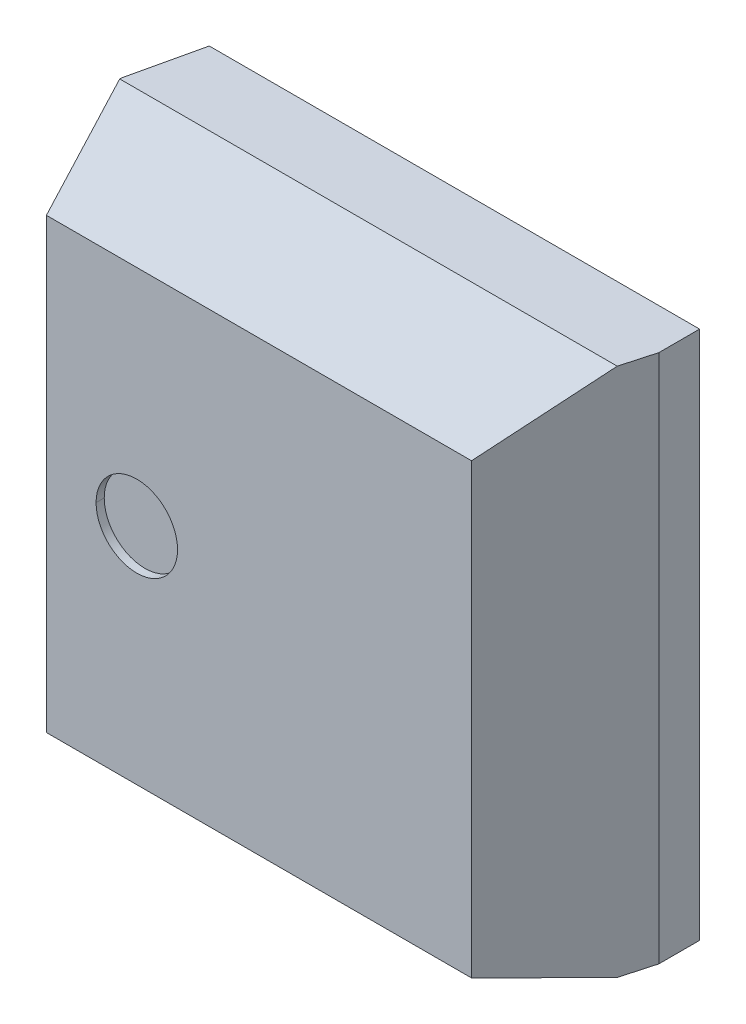
ISO-10303-21;
HEADER;
FILE_DESCRIPTION(('STEP AP214'),'2;1');
FILE_NAME('part.step','',(''),(''),'','','');
FILE_SCHEMA(('AUTOMOTIVE_DESIGN { 1 0 10303 214 1 1 1 1 }'));
ENDSEC;
DATA;
#1=APPLICATION_CONTEXT('core data for automotive mechanical design processes');
#2=APPLICATION_PROTOCOL_DEFINITION('international standard','automotive_design',2000,#1);
#3=PRODUCT_CONTEXT('',#1,'mechanical');
#4=PRODUCT('Part','Part','',(#3));
#5=PRODUCT_RELATED_PRODUCT_CATEGORY('part','',(#4));
#6=PRODUCT_DEFINITION_FORMATION('','',#4);
#7=PRODUCT_DEFINITION_CONTEXT('part definition',#1,'design');
#8=PRODUCT_DEFINITION('design','',#6,#7);
#9=PRODUCT_DEFINITION_SHAPE('','',#8);
#10=(LENGTH_UNIT() NAMED_UNIT(*) SI_UNIT(.MILLI.,.METRE.));
#11=(NAMED_UNIT(*) PLANE_ANGLE_UNIT() SI_UNIT($,.RADIAN.));
#12=(NAMED_UNIT(*) SI_UNIT($,.STERADIAN.) SOLID_ANGLE_UNIT());
#13=UNCERTAINTY_MEASURE_WITH_UNIT(LENGTH_MEASURE(1.E-05),#10,'distance_accuracy_value','');
#14=(GEOMETRIC_REPRESENTATION_CONTEXT(3) GLOBAL_UNCERTAINTY_ASSIGNED_CONTEXT((#13)) GLOBAL_UNIT_ASSIGNED_CONTEXT((#10,
#11,#12)) REPRESENTATION_CONTEXT('',''));
#15=CARTESIAN_POINT('',(0.,0.,0.));
#16=DIRECTION('',(0.,0.,1.));
#17=DIRECTION('',(1.,0.,0.));
#18=AXIS2_PLACEMENT_3D('',#15,#16,#17);
#19=CARTESIAN_POINT('',(197.946744279938,101.53204329235,114.531582908599));
#20=DIRECTION('',(0.,0.,-1.));
#21=DIRECTION('',(-1.,0.,0.));
#22=AXIS2_PLACEMENT_3D('',#19,#20,#21);
#23=CYLINDRICAL_SURFACE('',#22,0.5);
#24=CARTESIAN_POINT('',(197.946744279938,101.53204329235,114.531582908599));
#25=DIRECTION('',(0.,0.,-1.));
#26=DIRECTION('',(-1.,0.,0.));
#27=AXIS2_PLACEMENT_3D('',#24,#25,#26);
#28=CIRCLE('',#27,0.5);
#29=CARTESIAN_POINT('',(198.446744279938,101.53204329235,114.531582908599));
#30=VERTEX_POINT('',#29);
#31=CARTESIAN_POINT('',(197.446744279938,101.53204329235,114.531582908599));
#32=VERTEX_POINT('',#31);
#33=EDGE_CURVE('E67',#30,#32,#28,.T.);
#34=ORIENTED_EDGE('',*,*,#33,.F.);
#35=DIRECTION('',(0.,0.,-1.));
#36=VECTOR('',#35,1.);
#37=CARTESIAN_POINT('',(198.446744279938,101.53204329235,114.531582908599));
#38=LINE('',#37,#36);
#39=CARTESIAN_POINT('',(198.446744279938,101.53204329235,114.431582908599));
#40=VERTEX_POINT('',#39);
#41=EDGE_CURVE('E11',#30,#40,#38,.T.);
#42=ORIENTED_EDGE('',*,*,#41,.T.);
#43=CARTESIAN_POINT('',(197.946744279938,101.53204329235,114.431582908599));
#44=DIRECTION('',(0.,0.,-1.));
#45=DIRECTION('',(-1.,0.,0.));
#46=AXIS2_PLACEMENT_3D('',#43,#44,#45);
#47=CIRCLE('',#46,0.5);
#48=CARTESIAN_POINT('',(197.446744279938,101.53204329235,114.431582908599));
#49=VERTEX_POINT('',#48);
#50=EDGE_CURVE('E55',#40,#49,#47,.T.);
#51=ORIENTED_EDGE('',*,*,#50,.T.);
#52=DIRECTION('',(0.,0.,-1.));
#53=VECTOR('',#52,1.);
#54=CARTESIAN_POINT('',(197.446744279938,101.53204329235,114.531582908599));
#55=LINE('',#54,#53);
#56=EDGE_CURVE('E48',#32,#49,#55,.T.);
#57=ORIENTED_EDGE('',*,*,#56,.F.);
#58=EDGE_LOOP('',(#34,#42,#51,#57));
#59=FACE_BOUND('',#58,.T.);
#60=ADVANCED_FACE('F44',(#59),#23,.F.);
#61=CARTESIAN_POINT('',(197.946744279938,101.53204329235,114.431582908599));
#62=DIRECTION('',(0.,0.,-1.));
#63=DIRECTION('',(-1.,0.,0.));
#64=AXIS2_PLACEMENT_3D('',#61,#62,#63);
#65=PLANE('',#64);
#66=CARTESIAN_POINT('',(197.946744279938,101.53204329235,114.431582908599));
#67=DIRECTION('',(0.,0.,-1.));
#68=DIRECTION('',(-1.,0.,0.));
#69=AXIS2_PLACEMENT_3D('',#66,#67,#68);
#70=CIRCLE('',#69,0.5);
#71=EDGE_CURVE('E241',#49,#40,#70,.T.);
#72=ORIENTED_EDGE('',*,*,#71,.F.);
#73=ORIENTED_EDGE('',*,*,#50,.F.);
#74=EDGE_LOOP('',(#72,#73));
#75=FACE_BOUND('',#74,.T.);
#76=ADVANCED_FACE('F305',(#75),#65,.F.);
#77=CARTESIAN_POINT('',(197.946744279938,101.53204329235,114.531582908599));
#78=DIRECTION('',(0.,0.,-1.));
#79=DIRECTION('',(-1.,0.,0.));
#80=AXIS2_PLACEMENT_3D('',#77,#78,#79);
#81=CYLINDRICAL_SURFACE('',#80,0.5);
#82=ORIENTED_EDGE('',*,*,#41,.F.);
#83=CARTESIAN_POINT('',(197.946744279938,101.53204329235,114.531582908599));
#84=DIRECTION('',(0.,0.,-1.));
#85=DIRECTION('',(-1.,0.,0.));
#86=AXIS2_PLACEMENT_3D('',#83,#84,#85);
#87=CIRCLE('',#86,0.5);
#88=EDGE_CURVE('E202',#32,#30,#87,.T.);
#89=ORIENTED_EDGE('',*,*,#88,.F.);
#90=ORIENTED_EDGE('',*,*,#56,.T.);
#91=ORIENTED_EDGE('',*,*,#71,.T.);
#92=EDGE_LOOP('',(#82,#89,#90,#91));
#93=FACE_BOUND('',#92,.T.);
#94=ADVANCED_FACE('F310',(#93),#81,.F.);
#95=CARTESIAN_POINT('',(196.836744279938,98.5320432923502,113.831582908599));
#96=DIRECTION('',(0.,0.941741911594905,-0.336336396997966));
#97=DIRECTION('',(-1.,0.,0.));
#98=AXIS2_PLACEMENT_3D('',#95,#96,#97);
#99=PLANE('',#98);
#100=DIRECTION('',(1.,0.,0.));
#101=VECTOR('',#100,1.);
#102=CARTESIAN_POINT('',(196.836744279938,98.2820432923502,113.131582908599));
#103=LINE('',#102,#101);
#104=CARTESIAN_POINT('',(196.336744279938,98.2820432923502,113.131582908599));
#105=VERTEX_POINT('',#104);
#106=CARTESIAN_POINT('',(202.445633168827,98.2820432923502,113.131582908599));
#107=VERTEX_POINT('',#106);
#108=EDGE_CURVE('E245',#105,#107,#103,.T.);
#109=ORIENTED_EDGE('',*,*,#108,.T.);
#110=DIRECTION('',(0.253078917766085,-0.325387179985109,-0.911084103957305));
#111=VECTOR('',#110,1.);
#112=CARTESIAN_POINT('',(202.112924348954,98.7098117750442,114.329334660141));
#113=LINE('',#112,#111);
#114=CARTESIAN_POINT('',(202.056744279938,98.7820432923502,114.531582908599));
#115=VERTEX_POINT('',#114);
#116=EDGE_CURVE('E238',#115,#107,#113,.T.);
#117=ORIENTED_EDGE('',*,*,#116,.F.);
#118=DIRECTION('',(1.,0.,0.));
#119=VECTOR('',#118,1.);
#120=CARTESIAN_POINT('',(196.836744279938,98.7820432923502,114.531582908599));
#121=LINE('',#120,#119);
#122=CARTESIAN_POINT('',(196.836744279938,98.7820432923502,114.531582908599));
#123=VERTEX_POINT('',#122);
#124=EDGE_CURVE('E198',#123,#115,#121,.T.);
#125=ORIENTED_EDGE('',*,*,#124,.F.);
#126=DIRECTION('',(-0.31878835653184,-0.31878835653184,-0.892607398288552));
#127=VECTOR('',#126,1.);
#128=CARTESIAN_POINT('',(196.917028832784,98.8623278451962,114.756379656566));
#129=LINE('',#128,#127);
#130=EDGE_CURVE('E267',#123,#105,#129,.T.);
#131=ORIENTED_EDGE('',*,*,#130,.T.);
#132=EDGE_LOOP('',(#109,#117,#125,#131));
#133=FACE_BOUND('',#132,.T.);
#134=ADVANCED_FACE('F285',(#133),#99,.F.);
#135=CARTESIAN_POINT('',(199.446744279938,101.53204329235,114.531582908599));
#136=DIRECTION('',(0.,0.,1.));
#137=DIRECTION('',(1.,0.,0.));
#138=AXIS2_PLACEMENT_3D('',#135,#136,#137);
#139=PLANE('',#138);
#140=DIRECTION('',(0.,-1.,0.));
#141=VECTOR('',#140,1.);
#142=CARTESIAN_POINT('',(196.836744279938,104.78204329235,114.531582908599));
#143=LINE('',#142,#141);
#144=CARTESIAN_POINT('',(196.836744279938,104.28204329235,114.531582908599));
#145=VERTEX_POINT('',#144);
#146=EDGE_CURVE('E234',#145,#123,#143,.T.);
#147=ORIENTED_EDGE('',*,*,#146,.T.);
#148=ORIENTED_EDGE('',*,*,#124,.T.);
#149=DIRECTION('',(0.,1.,0.));
#150=VECTOR('',#149,1.);
#151=CARTESIAN_POINT('',(202.056744279938,98.2820432923502,114.531582908599));
#152=LINE('',#151,#150);
#153=CARTESIAN_POINT('',(202.056744279938,104.28204329235,114.531582908599));
#154=VERTEX_POINT('',#153);
#155=EDGE_CURVE('E221',#115,#154,#152,.T.);
#156=ORIENTED_EDGE('',*,*,#155,.T.);
#157=DIRECTION('',(-1.,0.,0.));
#158=VECTOR('',#157,1.);
#159=CARTESIAN_POINT('',(202.056744279938,104.28204329235,114.531582908599));
#160=LINE('',#159,#158);
#161=EDGE_CURVE('E206',#154,#145,#160,.T.);
#162=ORIENTED_EDGE('',*,*,#161,.T.);
#163=EDGE_LOOP('',(#147,#148,#156,#162));
#164=FACE_BOUND('',#163,.T.);
#165=ORIENTED_EDGE('',*,*,#88,.T.);
#166=ORIENTED_EDGE('',*,*,#33,.T.);
#167=EDGE_LOOP('',(#165,#166));
#168=FACE_BOUND('',#167,.T.);
#169=ADVANCED_FACE('F286',(#164,#168),#139,.T.);
#170=CARTESIAN_POINT('',(202.556744279938,98.2820432923502,112.231582908599));
#171=DIRECTION('',(-1.,0.,0.));
#172=DIRECTION('',(0.,0.,1.));
#173=AXIS2_PLACEMENT_3D('',#170,#171,#172);
#174=PLANE('',#173);
#175=DIRECTION('',(0.,1.,0.));
#176=VECTOR('',#175,1.);
#177=CARTESIAN_POINT('',(202.556744279938,98.2820432923502,112.231582908599));
#178=LINE('',#177,#176);
#179=CARTESIAN_POINT('',(202.556744279938,98.2820432923502,112.231582908599));
#180=VERTEX_POINT('',#179);
#181=CARTESIAN_POINT('',(202.556744279938,104.78204329235,112.231582908599));
#182=VERTEX_POINT('',#181);
#183=EDGE_CURVE('E207',#180,#182,#178,.T.);
#184=ORIENTED_EDGE('',*,*,#183,.T.);
#185=DIRECTION('',(0.,0.,1.));
#186=VECTOR('',#185,1.);
#187=CARTESIAN_POINT('',(202.556744279938,104.78204329235,112.231582908599));
#188=LINE('',#187,#186);
#189=CARTESIAN_POINT('',(202.556744279938,104.78204329235,112.731582908599));
#190=VERTEX_POINT('',#189);
#191=EDGE_CURVE('E106',#182,#190,#188,.T.);
#192=ORIENTED_EDGE('',*,*,#191,.T.);
#193=DIRECTION('',(0.,1.,0.));
#194=VECTOR('',#193,1.);
#195=CARTESIAN_POINT('',(202.556744279938,98.2820432923502,112.731582908599));
#196=LINE('',#195,#194);
#197=CARTESIAN_POINT('',(202.556744279938,98.2820432923502,112.731582908599));
#198=VERTEX_POINT('',#197);
#199=EDGE_CURVE('E118',#198,#190,#196,.T.);
#200=ORIENTED_EDGE('',*,*,#199,.F.);
#201=DIRECTION('',(0.,0.,1.));
#202=VECTOR('',#201,1.);
#203=CARTESIAN_POINT('',(202.556744279938,98.2820432923502,112.231582908599));
#204=LINE('',#203,#202);
#205=EDGE_CURVE('E127',#180,#198,#204,.T.);
#206=ORIENTED_EDGE('',*,*,#205,.F.);
#207=EDGE_LOOP('',(#184,#192,#200,#206));
#208=FACE_BOUND('',#207,.T.);
#209=ADVANCED_FACE('F283',(#208),#174,.F.);
#210=CARTESIAN_POINT('',(202.306744279938,98.2820432923502,113.631582908599));
#211=DIRECTION('',(-0.963517909629969,0.,-0.267643863785991));
#212=DIRECTION('',(-0.267643863785991,0.,0.963517909629969));
#213=AXIS2_PLACEMENT_3D('',#210,#211,#212);
#214=PLANE('',#213);
#215=ORIENTED_EDGE('',*,*,#155,.F.);
#216=ORIENTED_EDGE('',*,*,#116,.T.);
#217=DIRECTION('',(-0.267643863785991,0.,0.963517909629969));
#218=VECTOR('',#217,1.);
#219=CARTESIAN_POINT('',(202.273434824351,98.2820432923502,113.751496948714));
#220=LINE('',#219,#218);
#221=EDGE_CURVE('E219',#198,#107,#220,.T.);
#222=ORIENTED_EDGE('',*,*,#221,.F.);
#223=ORIENTED_EDGE('',*,*,#199,.T.);
#224=DIRECTION('',(-0.267643863785991,0.,0.963517909629969));
#225=VECTOR('',#224,1.);
#226=CARTESIAN_POINT('',(202.496214193978,104.78204329235,112.949491218055));
#227=LINE('',#226,#225);
#228=CARTESIAN_POINT('',(202.445633168827,104.78204329235,113.131582908599));
#229=VERTEX_POINT('',#228);
#230=EDGE_CURVE('E210',#190,#229,#227,.T.);
#231=ORIENTED_EDGE('',*,*,#230,.T.);
#232=DIRECTION('',(0.253078917766085,0.325387179985109,-0.911084103957305));
#233=VECTOR('',#232,1.);
#234=CARTESIAN_POINT('',(202.012459013808,104.22510509304,114.691009866667));
#235=LINE('',#234,#233);
#236=EDGE_CURVE('E139',#154,#229,#235,.T.);
#237=ORIENTED_EDGE('',*,*,#236,.F.);
#238=EDGE_LOOP('',(#215,#216,#222,#223,#231,#237));
#239=FACE_BOUND('',#238,.T.);
#240=ADVANCED_FACE('F284',(#239),#214,.F.);
#241=CARTESIAN_POINT('',(199.446744279938,101.53204329235,112.231582908599));
#242=DIRECTION('',(0.,0.,1.));
#243=DIRECTION('',(1.,0.,0.));
#244=AXIS2_PLACEMENT_3D('',#241,#242,#243);
#245=PLANE('',#244);
#246=DIRECTION('',(0.,-1.,0.));
#247=VECTOR('',#246,1.);
#248=CARTESIAN_POINT('',(196.536744279938,104.78204329235,112.231582908599));
#249=LINE('',#248,#247);
#250=CARTESIAN_POINT('',(196.536744279938,104.78204329235,112.231582908599));
#251=VERTEX_POINT('',#250);
#252=CARTESIAN_POINT('',(196.536744279938,98.2820432923502,112.231582908599));
#253=VERTEX_POINT('',#252);
#254=EDGE_CURVE('E182',#251,#253,#249,.T.);
#255=ORIENTED_EDGE('',*,*,#254,.F.);
#256=DIRECTION('',(-1.,0.,0.));
#257=VECTOR('',#256,1.);
#258=CARTESIAN_POINT('',(202.556744279938,104.78204329235,112.231582908599));
#259=LINE('',#258,#257);
#260=EDGE_CURVE('E179',#182,#251,#259,.T.);
#261=ORIENTED_EDGE('',*,*,#260,.F.);
#262=ORIENTED_EDGE('',*,*,#183,.F.);
#263=DIRECTION('',(1.,0.,0.));
#264=VECTOR('',#263,1.);
#265=CARTESIAN_POINT('',(196.336744279938,98.2820432923502,112.231582908599));
#266=LINE('',#265,#264);
#267=EDGE_CURVE('E201',#253,#180,#266,.T.);
#268=ORIENTED_EDGE('',*,*,#267,.F.);
#269=EDGE_LOOP('',(#255,#261,#262,#268));
#270=FACE_BOUND('',#269,.T.);
#271=ADVANCED_FACE('F46',(#270),#245,.F.);
#272=CARTESIAN_POINT('',(202.056744279938,104.53204329235,113.831582908599));
#273=DIRECTION('',(0.,-0.941741911594905,-0.336336396997966));
#274=DIRECTION('',(0.,0.336336396997966,-0.941741911594905));
#275=AXIS2_PLACEMENT_3D('',#272,#273,#274);
#276=PLANE('',#275);
#277=DIRECTION('',(-1.,0.,0.));
#278=VECTOR('',#277,1.);
#279=CARTESIAN_POINT('',(202.056744279938,104.78204329235,113.131582908599));
#280=LINE('',#279,#278);
#281=CARTESIAN_POINT('',(196.336744279938,104.78204329235,113.131582908599));
#282=VERTEX_POINT('',#281);
#283=EDGE_CURVE('E213',#229,#282,#280,.T.);
#284=ORIENTED_EDGE('',*,*,#283,.T.);
#285=DIRECTION('',(-0.31878835653184,0.31878835653184,-0.892607398288552));
#286=VECTOR('',#285,1.);
#287=CARTESIAN_POINT('',(196.851988182377,104.266799389911,114.574265835428));
#288=LINE('',#287,#286);
#289=EDGE_CURVE('E217',#145,#282,#288,.T.);
#290=ORIENTED_EDGE('',*,*,#289,.F.);
#291=ORIENTED_EDGE('',*,*,#161,.F.);
#292=ORIENTED_EDGE('',*,*,#236,.T.);
#293=EDGE_LOOP('',(#284,#290,#291,#292));
#294=FACE_BOUND('',#293,.T.);
#295=ADVANCED_FACE('F290',(#294),#276,.F.);
#296=CARTESIAN_POINT('',(196.336744279938,98.2820432923502,112.231582908599));
#297=DIRECTION('',(0.,1.,0.));
#298=DIRECTION('',(1.,0.,0.));
#299=AXIS2_PLACEMENT_3D('',#296,#297,#298);
#300=PLANE('',#299);
#301=DIRECTION('',(0.221621103589098,0.,-0.97513285579143));
#302=VECTOR('',#301,1.);
#303=CARTESIAN_POINT('',(196.481832688582,98.2820432923502,112.473193910564));
#304=LINE('',#303,#302);
#305=CARTESIAN_POINT('',(196.336744279938,98.2820432923502,113.111582908599));
#306=VERTEX_POINT('',#305);
#307=EDGE_CURVE('E168',#306,#253,#304,.T.);
#308=ORIENTED_EDGE('',*,*,#307,.T.);
#309=ORIENTED_EDGE('',*,*,#267,.T.);
#310=ORIENTED_EDGE('',*,*,#205,.T.);
#311=ORIENTED_EDGE('',*,*,#221,.T.);
#312=ORIENTED_EDGE('',*,*,#108,.F.);
#313=DIRECTION('',(0.,0.,1.));
#314=VECTOR('',#313,1.);
#315=CARTESIAN_POINT('',(196.336744279938,98.2820432923502,112.231582908599));
#316=LINE('',#315,#314);
#317=EDGE_CURVE('E173',#306,#105,#316,.T.);
#318=ORIENTED_EDGE('',*,*,#317,.F.);
#319=EDGE_LOOP('',(#308,#309,#310,#311,#312,#318));
#320=FACE_BOUND('',#319,.T.);
#321=ADVANCED_FACE('F293',(#320),#300,.F.);
#322=CARTESIAN_POINT('',(196.586744279938,104.78204329235,113.831582908599));
#323=DIRECTION('',(0.941741911594905,0.,-0.336336396997966));
#324=DIRECTION('',(0.,-1.,0.));
#325=AXIS2_PLACEMENT_3D('',#322,#323,#324);
#326=PLANE('',#325);
#327=ORIENTED_EDGE('',*,*,#289,.T.);
#328=DIRECTION('',(0.,-1.,0.));
#329=VECTOR('',#328,1.);
#330=CARTESIAN_POINT('',(196.336744279938,104.78204329235,113.131582908599));
#331=LINE('',#330,#329);
#332=EDGE_CURVE('E187',#282,#105,#331,.T.);
#333=ORIENTED_EDGE('',*,*,#332,.T.);
#334=ORIENTED_EDGE('',*,*,#130,.F.);
#335=ORIENTED_EDGE('',*,*,#146,.F.);
#336=EDGE_LOOP('',(#327,#333,#334,#335));
#337=FACE_BOUND('',#336,.T.);
#338=ADVANCED_FACE('F289',(#337),#326,.F.);
#339=CARTESIAN_POINT('',(196.436744279938,104.78204329235,112.671582908599));
#340=DIRECTION('',(-0.97513285579143,0.,-0.221621103589098));
#341=DIRECTION('',(-0.221621103589098,0.,0.97513285579143));
#342=AXIS2_PLACEMENT_3D('',#339,#340,#341);
#343=PLANE('',#342);
#344=ORIENTED_EDGE('',*,*,#254,.T.);
#345=ORIENTED_EDGE('',*,*,#307,.F.);
#346=DIRECTION('',(0.,-1.,0.));
#347=VECTOR('',#346,1.);
#348=CARTESIAN_POINT('',(196.336744279938,104.78204329235,113.111582908599));
#349=LINE('',#348,#347);
#350=CARTESIAN_POINT('',(196.336744279938,104.78204329235,113.111582908599));
#351=VERTEX_POINT('',#350);
#352=EDGE_CURVE('E163',#351,#306,#349,.T.);
#353=ORIENTED_EDGE('',*,*,#352,.F.);
#354=DIRECTION('',(0.221621103589098,0.,-0.97513285579143));
#355=VECTOR('',#354,1.);
#356=CARTESIAN_POINT('',(196.634583179742,104.78204329235,111.801091749463));
#357=LINE('',#356,#355);
#358=EDGE_CURVE('E166',#351,#251,#357,.T.);
#359=ORIENTED_EDGE('',*,*,#358,.T.);
#360=EDGE_LOOP('',(#344,#345,#353,#359));
#361=FACE_BOUND('',#360,.T.);
#362=ADVANCED_FACE('F165',(#361),#343,.T.);
#363=CARTESIAN_POINT('',(202.556744279938,104.78204329235,112.231582908599));
#364=DIRECTION('',(0.,-1.,0.));
#365=DIRECTION('',(0.,0.,-1.));
#366=AXIS2_PLACEMENT_3D('',#363,#364,#365);
#367=PLANE('',#366);
#368=ORIENTED_EDGE('',*,*,#283,.F.);
#369=ORIENTED_EDGE('',*,*,#230,.F.);
#370=ORIENTED_EDGE('',*,*,#191,.F.);
#371=ORIENTED_EDGE('',*,*,#260,.T.);
#372=ORIENTED_EDGE('',*,*,#358,.F.);
#373=DIRECTION('',(0.,0.,1.));
#374=VECTOR('',#373,1.);
#375=CARTESIAN_POINT('',(196.336744279938,104.78204329235,112.231582908599));
#376=LINE('',#375,#374);
#377=EDGE_CURVE('E172',#351,#282,#376,.T.);
#378=ORIENTED_EDGE('',*,*,#377,.T.);
#379=EDGE_LOOP('',(#368,#369,#370,#371,#372,#378));
#380=FACE_BOUND('',#379,.T.);
#381=ADVANCED_FACE('F177',(#380),#367,.F.);
#382=CARTESIAN_POINT('',(196.336744279938,104.78204329235,112.231582908599));
#383=DIRECTION('',(1.,0.,0.));
#384=DIRECTION('',(0.,1.,0.));
#385=AXIS2_PLACEMENT_3D('',#382,#383,#384);
#386=PLANE('',#385);
#387=ORIENTED_EDGE('',*,*,#352,.T.);
#388=ORIENTED_EDGE('',*,*,#317,.T.);
#389=ORIENTED_EDGE('',*,*,#332,.F.);
#390=ORIENTED_EDGE('',*,*,#377,.F.);
#391=EDGE_LOOP('',(#387,#388,#389,#390));
#392=FACE_BOUND('',#391,.T.);
#393=ADVANCED_FACE('F185',(#392),#386,.F.);
#394=CLOSED_SHELL('',(#60,#76,#94,#134,#169,#209,#240,#271,#295,#321,#338,#362,#381,#393));
#395=MANIFOLD_SOLID_BREP('B2',#394);
#396=ADVANCED_BREP_SHAPE_REPRESENTATION('',(#18,#395),#14);
#397=SHAPE_DEFINITION_REPRESENTATION(#9,#396);
ENDSEC;
END-ISO-10303-21;
